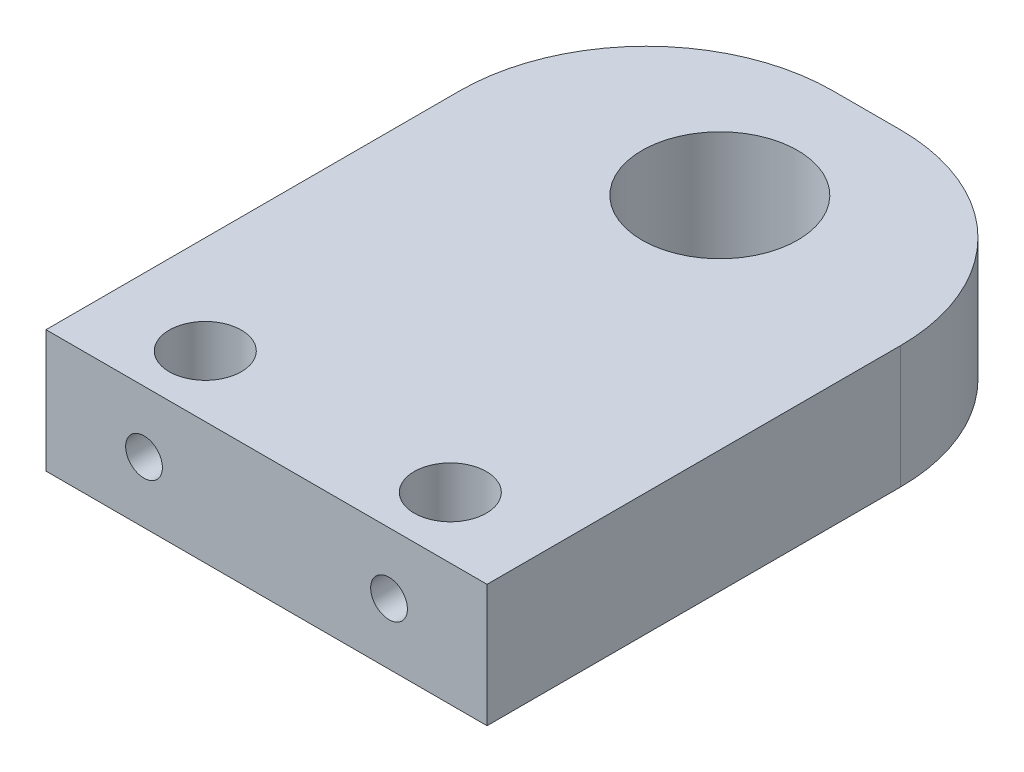
ISO-10303-21;
HEADER;
FILE_DESCRIPTION(('STEP AP214'),'2;1');
FILE_NAME('part.step','',(''),(''),'','','');
FILE_SCHEMA(('AUTOMOTIVE_DESIGN { 1 0 10303 214 1 1 1 1 }'));
ENDSEC;
DATA;
#1=APPLICATION_CONTEXT('core data for automotive mechanical design processes');
#2=APPLICATION_PROTOCOL_DEFINITION('international standard','automotive_design',2000,#1);
#3=PRODUCT_CONTEXT('',#1,'mechanical');
#4=PRODUCT('Part','Part','',(#3));
#5=PRODUCT_RELATED_PRODUCT_CATEGORY('part','',(#4));
#6=PRODUCT_DEFINITION_FORMATION('','',#4);
#7=PRODUCT_DEFINITION_CONTEXT('part definition',#1,'design');
#8=PRODUCT_DEFINITION('design','',#6,#7);
#9=PRODUCT_DEFINITION_SHAPE('','',#8);
#10=(LENGTH_UNIT() NAMED_UNIT(*) SI_UNIT(.MILLI.,.METRE.));
#11=(NAMED_UNIT(*) PLANE_ANGLE_UNIT() SI_UNIT($,.RADIAN.));
#12=(NAMED_UNIT(*) SI_UNIT($,.STERADIAN.) SOLID_ANGLE_UNIT());
#13=UNCERTAINTY_MEASURE_WITH_UNIT(LENGTH_MEASURE(1.E-05),#10,'distance_accuracy_value','');
#14=(GEOMETRIC_REPRESENTATION_CONTEXT(3) GLOBAL_UNCERTAINTY_ASSIGNED_CONTEXT((#13)) GLOBAL_UNIT_ASSIGNED_CONTEXT((#10,
#11,#12)) REPRESENTATION_CONTEXT('',''));
#15=CARTESIAN_POINT('',(0.,0.,0.));
#16=DIRECTION('',(0.,0.,1.));
#17=DIRECTION('',(1.,0.,0.));
#18=AXIS2_PLACEMENT_3D('',#15,#16,#17);
#19=CARTESIAN_POINT('',(0.,5.,0.));
#20=DIRECTION('',(0.,0.,-1.));
#21=DIRECTION('',(-1.,0.,0.));
#22=AXIS2_PLACEMENT_3D('',#19,#20,#21);
#23=PLANE('',#22);
#24=DIRECTION('',(1.,0.,0.));
#25=VECTOR('',#24,1.);
#26=CARTESIAN_POINT('',(0.,0.,0.));
#27=LINE('',#26,#25);
#28=CARTESIAN_POINT('',(-18.,0.,0.));
#29=VERTEX_POINT('',#28);
#30=CARTESIAN_POINT('',(0.,0.,0.));
#31=VERTEX_POINT('',#30);
#32=EDGE_CURVE('E120',#29,#31,#27,.T.);
#33=ORIENTED_EDGE('',*,*,#32,.T.);
#34=DIRECTION('',(0.,-1.,0.));
#35=VECTOR('',#34,1.);
#36=CARTESIAN_POINT('',(0.,5.,0.));
#37=LINE('',#36,#35);
#38=CARTESIAN_POINT('',(0.,5.,0.));
#39=VERTEX_POINT('',#38);
#40=EDGE_CURVE('E105',#39,#31,#37,.T.);
#41=ORIENTED_EDGE('',*,*,#40,.F.);
#42=DIRECTION('',(1.,0.,0.));
#43=VECTOR('',#42,1.);
#44=CARTESIAN_POINT('',(0.,5.,0.));
#45=LINE('',#44,#43);
#46=CARTESIAN_POINT('',(-18.,5.,0.));
#47=VERTEX_POINT('',#46);
#48=EDGE_CURVE('E91',#47,#39,#45,.T.);
#49=ORIENTED_EDGE('',*,*,#48,.F.);
#50=DIRECTION('',(0.,-1.,0.));
#51=VECTOR('',#50,1.);
#52=CARTESIAN_POINT('',(-18.,5.,0.));
#53=LINE('',#52,#51);
#54=EDGE_CURVE('E98',#47,#29,#53,.T.);
#55=ORIENTED_EDGE('',*,*,#54,.T.);
#56=EDGE_LOOP('',(#33,#41,#49,#55));
#57=FACE_BOUND('',#56,.T.);
#58=CARTESIAN_POINT('',(-14.,2.5,0.));
#59=DIRECTION('',(0.,0.,1.));
#60=DIRECTION('',(1.,0.,0.));
#61=AXIS2_PLACEMENT_3D('',#58,#59,#60);
#62=CIRCLE('',#61,0.75);
#63=CARTESIAN_POINT('',(-13.25,2.5,0.));
#64=VERTEX_POINT('',#63);
#65=EDGE_CURVE('E131',#64,#64,#62,.T.);
#66=ORIENTED_EDGE('',*,*,#65,.F.);
#67=EDGE_LOOP('',(#66));
#68=FACE_BOUND('',#67,.T.);
#69=CARTESIAN_POINT('',(-4.,2.5,0.));
#70=DIRECTION('',(0.,0.,-1.));
#71=DIRECTION('',(-1.,0.,0.));
#72=AXIS2_PLACEMENT_3D('',#69,#70,#71);
#73=CIRCLE('',#72,0.75);
#74=CARTESIAN_POINT('',(-4.75,2.5,0.));
#75=VERTEX_POINT('',#74);
#76=EDGE_CURVE('E214',#75,#75,#73,.T.);
#77=ORIENTED_EDGE('',*,*,#76,.T.);
#78=EDGE_LOOP('',(#77));
#79=FACE_BOUND('',#78,.T.);
#80=ADVANCED_FACE('F33',(#57,#68,#79),#23,.F.);
#81=CARTESIAN_POINT('',(-4.,0.,-2.5));
#82=DIRECTION('',(0.,1.,0.));
#83=DIRECTION('',(0.,0.,1.));
#84=AXIS2_PLACEMENT_3D('',#81,#82,#83);
#85=CYLINDRICAL_SURFACE('',#84,1.4732);
#86=CARTESIAN_POINT('',(-4.,5.,-2.5));
#87=DIRECTION('',(0.,-1.,0.));
#88=DIRECTION('',(0.,0.,1.));
#89=AXIS2_PLACEMENT_3D('',#86,#87,#88);
#90=CIRCLE('',#89,1.4732);
#91=CARTESIAN_POINT('',(-4.,5.,-1.0268));
#92=VERTEX_POINT('',#91);
#93=EDGE_CURVE('E209',#92,#92,#90,.T.);
#94=ORIENTED_EDGE('',*,*,#93,.F.);
#95=EDGE_LOOP('',(#94));
#96=FACE_BOUND('',#95,.T.);
#97=CARTESIAN_POINT('',(-4.,0.,-2.5));
#98=DIRECTION('',(0.,-1.,0.));
#99=DIRECTION('',(0.,0.,1.));
#100=AXIS2_PLACEMENT_3D('',#97,#98,#99);
#101=CIRCLE('',#100,1.4732);
#102=CARTESIAN_POINT('',(-4.,0.,-1.0268));
#103=VERTEX_POINT('',#102);
#104=EDGE_CURVE('E208',#103,#103,#101,.T.);
#105=ORIENTED_EDGE('',*,*,#104,.T.);
#106=EDGE_LOOP('',(#105));
#107=FACE_BOUND('',#106,.T.);
#108=CARTESIAN_POINT('',(-4.,1.75,-1.0268));
#109=CARTESIAN_POINT('',(-3.9606575769154,1.75000252182764,-1.02680220611836));
#110=CARTESIAN_POINT('',(-3.92127085127802,1.75311380635591,-1.02839274569372));
#111=CARTESIAN_POINT('',(-3.84366695752669,1.76541875095237,-1.03459878502963));
#112=CARTESIAN_POINT('',(-3.80545203284723,1.77462339836188,-1.03921974900572));
#113=CARTESIAN_POINT('',(-3.73143168372679,1.79865892412454,-1.05100426533486));
#114=CARTESIAN_POINT('',(-3.69561742756561,1.81346767720986,-1.05815781186486));
#115=CARTESIAN_POINT('',(-3.62703792099485,1.84817354316779,-1.07435597490672));
#116=CARTESIAN_POINT('',(-3.59427250190444,1.86807037430738,-1.0834004867085));
#117=CARTESIAN_POINT('',(-3.53043416268617,1.91378875585433,-1.10321390423135));
#118=CARTESIAN_POINT('',(-3.49959239938986,1.93990131852553,-1.11405498369676));
#119=CARTESIAN_POINT('',(-3.44251181723256,1.99668130616915,-1.13601238540455));
#120=CARTESIAN_POINT('',(-3.41627664483487,2.02735230434501,-1.1471289178172));
#121=CARTESIAN_POINT('',(-3.36701624260865,2.09535959625278,-1.16942158074621));
#122=CARTESIAN_POINT('',(-3.34442423922562,2.13303479409838,-1.18052934811384));
#123=CARTESIAN_POINT('',(-3.30599217355733,2.21227127261359,-1.20033012525784));
#124=CARTESIAN_POINT('',(-3.29014716455627,2.25382967886272,-1.2090249025395));
#125=CARTESIAN_POINT('',(-3.2667106686897,2.33708815783487,-1.2221983401406));
#126=CARTESIAN_POINT('',(-3.25867627658924,2.37862626620457,-1.22690103134074));
#127=CARTESIAN_POINT('',(-3.24973928831067,2.4627046380928,-1.23214465460714));
#128=CARTESIAN_POINT('',(-3.2488291632929,2.50524379600033,-1.2326899801115));
#129=CARTESIAN_POINT('',(-3.25384221734925,2.58438886607509,-1.22973613373844));
#130=CARTESIAN_POINT('',(-3.25892473074875,2.62107124425613,-1.22673443128719));
#131=CARTESIAN_POINT('',(-3.2743168786561,2.69296668969559,-1.21790007891102));
#132=CARTESIAN_POINT('',(-3.28462828429265,2.72817925472248,-1.21206646979218));
#133=CARTESIAN_POINT('',(-3.31036687110798,2.7971417479471,-1.19810064393931));
#134=CARTESIAN_POINT('',(-3.32590711622532,2.8308388382548,-1.18991827089551));
#135=CARTESIAN_POINT('',(-3.36157407945457,2.89531155218324,-1.17217207409054));
#136=CARTESIAN_POINT('',(-3.38170285938505,2.92608585364078,-1.16260763001714));
#137=CARTESIAN_POINT('',(-3.42907358339413,2.98811905843063,-1.14164937911975));
#138=CARTESIAN_POINT('',(-3.45690391182593,3.01890499253937,-1.13018081338474));
#139=CARTESIAN_POINT('',(-3.51736916210693,3.07557400398551,-1.10772627824621));
#140=CARTESIAN_POINT('',(-3.55000652867346,3.1014545711918,-1.09674055811675));
#141=CARTESIAN_POINT('',(-3.62121065036388,3.14879467746589,-1.07582331832222));
#142=CARTESIAN_POINT('',(-3.65999168530099,3.16997002579974,-1.06597149335067));
#143=CARTESIAN_POINT('',(-3.74119338186991,3.20531928296675,-1.04912059732702));
#144=CARTESIAN_POINT('',(-3.78361102113814,3.21949894092728,-1.04211918460802));
#145=CARTESIAN_POINT('',(-3.86702605671379,3.23925390951702,-1.0322642707464));
#146=CARTESIAN_POINT('',(-3.90783878203494,3.24545698889539,-1.02910933279456));
#147=CARTESIAN_POINT('',(-3.99004140438883,3.25106282250464,-1.02626089305485));
#148=CARTESIAN_POINT('',(-4.03143100236032,3.25046897833976,-1.02656565981445));
#149=CARTESIAN_POINT('',(-4.11004388958276,3.24284799668576,-1.03043107230061));
#150=CARTESIAN_POINT('',(-4.14733310550133,3.23634581920992,-1.03372600893934));
#151=CARTESIAN_POINT('',(-4.22021205515197,3.21792738586372,-1.04288836560886));
#152=CARTESIAN_POINT('',(-4.2558016040693,3.20601054269962,-1.04875606468811));
#153=CARTESIAN_POINT('',(-4.32542048329048,3.17680614771442,-1.06274002278413));
#154=CARTESIAN_POINT('',(-4.35937907768151,3.15937869059891,-1.07091417915435));
#155=CARTESIAN_POINT('',(-4.42399884376647,3.11980817357101,-1.0887351393782));
#156=CARTESIAN_POINT('',(-4.45465862799573,3.09766314104638,-1.09838255878437));
#157=CARTESIAN_POINT('',(-4.51509372863443,3.04671213453437,-1.1193768507009));
#158=CARTESIAN_POINT('',(-4.54446769612563,3.01745953687217,-1.13079698072104));
#159=CARTESIAN_POINT('',(-4.5980781301437,2.95444016834433,-1.15334919384521));
#160=CARTESIAN_POINT('',(-4.62231071892922,2.92067002132162,-1.16448105401358));
#161=CARTESIAN_POINT('',(-4.66617769744531,2.84731591321446,-1.18578834541354));
#162=CARTESIAN_POINT('',(-4.68549806820531,2.80751798449864,-1.19588114688589));
#163=CARTESIAN_POINT('',(-4.71696120610427,2.724560956178,-1.21290660102605));
#164=CARTESIAN_POINT('',(-4.72911353520273,2.68140642161965,-1.21984346078879));
#165=CARTESIAN_POINT('',(-4.74474877040614,2.59742838681212,-1.22888165798232));
#166=CARTESIAN_POINT('',(-4.74895813510497,2.55678468886243,-1.23138669798332));
#167=CARTESIAN_POINT('',(-4.75069842260732,2.47531221208382,-1.23241473572249));
#168=CARTESIAN_POINT('',(-4.74823261605862,2.43448353367685,-1.23093968359598));
#169=CARTESIAN_POINT('',(-4.73737767764283,2.35820390915363,-1.22460825366367));
#170=CARTESIAN_POINT('',(-4.72961872994686,2.32262937710914,-1.22011231848875));
#171=CARTESIAN_POINT('',(-4.70919744096633,2.25333285712194,-1.20868543628832));
#172=CARTESIAN_POINT('',(-4.6965334724026,2.21961148822462,-1.20175368123131));
#173=CARTESIAN_POINT('',(-4.66571945055161,2.1524770700304,-1.18567267984056));
#174=CARTESIAN_POINT('',(-4.64725924790321,2.11923532867513,-1.17640617206837));
#175=CARTESIAN_POINT('',(-4.60570968434182,2.05610179697262,-1.15688390470307));
#176=CARTESIAN_POINT('',(-4.58261787360086,2.02621179258232,-1.14662762307809));
#177=CARTESIAN_POINT('',(-4.52900879336052,1.96665905934449,-1.12471503727741));
#178=CARTESIAN_POINT('',(-4.49791995330916,1.93751228683933,-1.11304712612774));
#179=CARTESIAN_POINT('',(-4.43098723530952,1.8847222720177,-1.09081189075967));
#180=CARTESIAN_POINT('',(-4.39514069295212,1.86108213411612,-1.08024518920398));
#181=CARTESIAN_POINT('',(-4.31904012814387,1.81984774473697,-1.0612204142898));
#182=CARTESIAN_POINT('',(-4.27874104058887,1.80232453391943,-1.05278741193376));
#183=CARTESIAN_POINT('',(-4.19525709236962,1.77453604062966,-1.03918941052837));
#184=CARTESIAN_POINT('',(-4.15208068628279,1.7642504388377,-1.03401526667987));
#185=CARTESIAN_POINT('',(-4.09036566113959,1.75524285719092,-1.02946337062287));
#186=CARTESIAN_POINT('',(-4.07236660880907,1.75327979281625,-1.02846742332499));
#187=CARTESIAN_POINT('',(-4.03624817540604,1.75065776575804,-1.02713522090723));
#188=CARTESIAN_POINT('',(-4.01812879112818,1.74999883795448,-1.02679898343173));
#189=CARTESIAN_POINT('',(-4.,1.75,-1.0268));
#190=B_SPLINE_CURVE_WITH_KNOTS('',3,(#108,#109,#110,#111,#112,#113,#114,#115,#116,#117,#118,
#119,#120,#121,#122,#123,#124,#125,#126,#127,#128,#129,#130,#131,#132,#133,#134,#135,#136,#137,
#138,#139,#140,#141,#142,#143,#144,#145,#146,#147,#148,#149,#150,#151,#152,#153,#154,#155,#156,
#157,#158,#159,#160,#161,#162,#163,#164,#165,#166,#167,#168,#169,#170,#171,#172,#173,#174,#175,
#176,#177,#178,#179,#180,#181,#182,#183,#184,#185,#186,#187,#188,#189),.UNSPECIFIED.,.T.,.F.,(4,
2,2,2,2,2,2,2,2,2,2,2,2,2,2,2,2,2,2,2,2,2,2,2,2,2,2,2,2,2,2,2,2,2,2,2,2,2,2,2,4),(0.,
0.117953831094887,0.236120933920976,0.353826294049233,0.471525138100365,0.596526863752337,
0.721627095925648,0.856878751847196,0.992031073414538,1.11897330231829,1.24578136206803,
1.35672452799631,1.46770529768442,1.58125909715074,1.69486402196815,1.82347557718113,
1.95215276773095,2.08723511632051,2.22220626721413,2.34572997941948,2.46919187536339,
2.58265398090853,2.69612839589246,2.81275280644665,2.92942607851709,3.05787110094433,
3.18641265774705,3.32180714125343,3.45702060157646,3.5791212303752,3.70116204410018,
3.81074803422157,3.92037041153902,4.03732101273993,4.1543336373271,4.28628145323537,
4.4183034768474,4.55181140017204,4.68494299314672,4.7392940729611,4.79364660641054),.UNSPECIFIED.);
#191=CARTESIAN_POINT('',(-4.,1.75,-1.0268));
#192=VERTEX_POINT('',#191);
#193=EDGE_CURVE('E132',#192,#192,#190,.T.);
#194=ORIENTED_EDGE('',*,*,#193,.T.);
#195=EDGE_LOOP('',(#194));
#196=FACE_BOUND('',#195,.T.);
#197=ADVANCED_FACE('F146',(#96,#107,#196),#85,.F.);
#198=CARTESIAN_POINT('',(0.,5.,-24.5));
#199=DIRECTION('',(0.,1.,0.));
#200=DIRECTION('',(0.,0.,1.));
#201=AXIS2_PLACEMENT_3D('',#198,#199,#200);
#202=PLANE('',#201);
#203=CARTESIAN_POINT('',(-9.,5.,-18.5));
#204=DIRECTION('',(0.,1.,0.));
#205=DIRECTION('',(0.,0.,1.));
#206=AXIS2_PLACEMENT_3D('',#203,#204,#205);
#207=CIRCLE('',#206,3.175);
#208=CARTESIAN_POINT('',(-9.,5.,-15.325));
#209=VERTEX_POINT('',#208);
#210=EDGE_CURVE('E220',#209,#209,#207,.T.);
#211=ORIENTED_EDGE('',*,*,#210,.F.);
#212=EDGE_LOOP('',(#211));
#213=FACE_BOUND('',#212,.T.);
#214=DIRECTION('',(0.,0.,-1.));
#215=VECTOR('',#214,1.);
#216=CARTESIAN_POINT('',(0.,5.,0.));
#217=LINE('',#216,#215);
#218=CARTESIAN_POINT('',(0.,5.,-16.88));
#219=VERTEX_POINT('',#218);
#220=EDGE_CURVE('E121',#39,#219,#217,.T.);
#221=ORIENTED_EDGE('',*,*,#220,.T.);
#222=CARTESIAN_POINT('',(-7.62,5.,-16.88));
#223=DIRECTION('',(0.,1.,0.));
#224=DIRECTION('',(0.,0.,1.));
#225=AXIS2_PLACEMENT_3D('',#222,#223,#224);
#226=CIRCLE('',#225,7.62);
#227=CARTESIAN_POINT('',(-7.62,5.,-24.5));
#228=VERTEX_POINT('',#227);
#229=EDGE_CURVE('E41',#219,#228,#226,.T.);
#230=ORIENTED_EDGE('',*,*,#229,.T.);
#231=DIRECTION('',(-1.,0.,0.));
#232=VECTOR('',#231,1.);
#233=CARTESIAN_POINT('',(0.,5.,-24.5));
#234=LINE('',#233,#232);
#235=CARTESIAN_POINT('',(-10.38,5.,-24.5));
#236=VERTEX_POINT('',#235);
#237=EDGE_CURVE('E95',#228,#236,#234,.T.);
#238=ORIENTED_EDGE('',*,*,#237,.T.);
#239=CARTESIAN_POINT('',(-10.38,5.,-16.88));
#240=DIRECTION('',(0.,1.,0.));
#241=DIRECTION('',(0.,0.,1.));
#242=AXIS2_PLACEMENT_3D('',#239,#240,#241);
#243=CIRCLE('',#242,7.62);
#244=CARTESIAN_POINT('',(-18.,5.,-16.88));
#245=VERTEX_POINT('',#244);
#246=EDGE_CURVE('E48',#236,#245,#243,.T.);
#247=ORIENTED_EDGE('',*,*,#246,.T.);
#248=DIRECTION('',(0.,0.,1.));
#249=VECTOR('',#248,1.);
#250=CARTESIAN_POINT('',(-18.,5.,0.));
#251=LINE('',#250,#249);
#252=EDGE_CURVE('E86',#245,#47,#251,.T.);
#253=ORIENTED_EDGE('',*,*,#252,.T.);
#254=ORIENTED_EDGE('',*,*,#48,.T.);
#255=EDGE_LOOP('',(#221,#230,#238,#247,#253,#254));
#256=FACE_BOUND('',#255,.T.);
#257=CARTESIAN_POINT('',(-14.,5.,-2.5));
#258=DIRECTION('',(0.,1.,0.));
#259=DIRECTION('',(0.,0.,1.));
#260=AXIS2_PLACEMENT_3D('',#257,#258,#259);
#261=CIRCLE('',#260,1.4732);
#262=CARTESIAN_POINT('',(-14.,5.,-1.0268));
#263=VERTEX_POINT('',#262);
#264=EDGE_CURVE('E130',#263,#263,#261,.T.);
#265=ORIENTED_EDGE('',*,*,#264,.F.);
#266=EDGE_LOOP('',(#265));
#267=FACE_BOUND('',#266,.T.);
#268=ORIENTED_EDGE('',*,*,#93,.T.);
#269=EDGE_LOOP('',(#268));
#270=FACE_BOUND('',#269,.T.);
#271=ADVANCED_FACE('F88',(#213,#256,#267,#270),#202,.T.);
#272=CARTESIAN_POINT('',(0.,0.,-24.5));
#273=DIRECTION('',(0.,1.,0.));
#274=DIRECTION('',(0.,0.,1.));
#275=AXIS2_PLACEMENT_3D('',#272,#273,#274);
#276=PLANE('',#275);
#277=CARTESIAN_POINT('',(-9.,0.,-18.5));
#278=DIRECTION('',(0.,1.,0.));
#279=DIRECTION('',(0.,0.,1.));
#280=AXIS2_PLACEMENT_3D('',#277,#278,#279);
#281=CIRCLE('',#280,3.175);
#282=CARTESIAN_POINT('',(-9.,0.,-15.325));
#283=VERTEX_POINT('',#282);
#284=EDGE_CURVE('E217',#283,#283,#281,.T.);
#285=ORIENTED_EDGE('',*,*,#284,.T.);
#286=EDGE_LOOP('',(#285));
#287=FACE_BOUND('',#286,.T.);
#288=DIRECTION('',(-1.,0.,0.));
#289=VECTOR('',#288,1.);
#290=CARTESIAN_POINT('',(0.,0.,-24.5));
#291=LINE('',#290,#289);
#292=CARTESIAN_POINT('',(-7.62,0.,-24.5));
#293=VERTEX_POINT('',#292);
#294=CARTESIAN_POINT('',(-10.38,0.,-24.5));
#295=VERTEX_POINT('',#294);
#296=EDGE_CURVE('E115',#293,#295,#291,.T.);
#297=ORIENTED_EDGE('',*,*,#296,.F.);
#298=CARTESIAN_POINT('',(-7.62,0.,-16.88));
#299=DIRECTION('',(0.,1.,0.));
#300=DIRECTION('',(0.,0.,1.));
#301=AXIS2_PLACEMENT_3D('',#298,#299,#300);
#302=CIRCLE('',#301,7.62);
#303=CARTESIAN_POINT('',(0.,0.,-16.88));
#304=VERTEX_POINT('',#303);
#305=EDGE_CURVE('E191',#293,#304,#302,.F.);
#306=ORIENTED_EDGE('',*,*,#305,.T.);
#307=DIRECTION('',(0.,0.,-1.));
#308=VECTOR('',#307,1.);
#309=CARTESIAN_POINT('',(0.,0.,0.));
#310=LINE('',#309,#308);
#311=EDGE_CURVE('E113',#31,#304,#310,.T.);
#312=ORIENTED_EDGE('',*,*,#311,.F.);
#313=ORIENTED_EDGE('',*,*,#32,.F.);
#314=DIRECTION('',(0.,0.,1.));
#315=VECTOR('',#314,1.);
#316=CARTESIAN_POINT('',(-18.,0.,0.));
#317=LINE('',#316,#315);
#318=CARTESIAN_POINT('',(-18.,0.,-16.88));
#319=VERTEX_POINT('',#318);
#320=EDGE_CURVE('E101',#319,#29,#317,.T.);
#321=ORIENTED_EDGE('',*,*,#320,.F.);
#322=CARTESIAN_POINT('',(-10.38,0.,-16.88));
#323=DIRECTION('',(0.,1.,0.));
#324=DIRECTION('',(0.,0.,1.));
#325=AXIS2_PLACEMENT_3D('',#322,#323,#324);
#326=CIRCLE('',#325,7.62);
#327=EDGE_CURVE('E193',#319,#295,#326,.F.);
#328=ORIENTED_EDGE('',*,*,#327,.T.);
#329=EDGE_LOOP('',(#297,#306,#312,#313,#321,#328));
#330=FACE_BOUND('',#329,.T.);
#331=CARTESIAN_POINT('',(-14.,0.,-2.5));
#332=DIRECTION('',(0.,1.,0.));
#333=DIRECTION('',(0.,0.,1.));
#334=AXIS2_PLACEMENT_3D('',#331,#332,#333);
#335=CIRCLE('',#334,1.4732);
#336=CARTESIAN_POINT('',(-14.,0.,-1.0268));
#337=VERTEX_POINT('',#336);
#338=EDGE_CURVE('E116',#337,#337,#335,.T.);
#339=ORIENTED_EDGE('',*,*,#338,.T.);
#340=EDGE_LOOP('',(#339));
#341=FACE_BOUND('',#340,.T.);
#342=ORIENTED_EDGE('',*,*,#104,.F.);
#343=EDGE_LOOP('',(#342));
#344=FACE_BOUND('',#343,.T.);
#345=ADVANCED_FACE('F170',(#287,#330,#341,#344),#276,.F.);
#346=CARTESIAN_POINT('',(0.,5.,0.));
#347=DIRECTION('',(-1.,0.,0.));
#348=DIRECTION('',(0.,0.,1.));
#349=AXIS2_PLACEMENT_3D('',#346,#347,#348);
#350=PLANE('',#349);
#351=ORIENTED_EDGE('',*,*,#311,.T.);
#352=DIRECTION('',(0.,-1.,0.));
#353=VECTOR('',#352,1.);
#354=CARTESIAN_POINT('',(0.,5.,-16.88));
#355=LINE('',#354,#353);
#356=EDGE_CURVE('E56',#304,#219,#355,.F.);
#357=ORIENTED_EDGE('',*,*,#356,.T.);
#358=ORIENTED_EDGE('',*,*,#220,.F.);
#359=ORIENTED_EDGE('',*,*,#40,.T.);
#360=EDGE_LOOP('',(#351,#357,#358,#359));
#361=FACE_BOUND('',#360,.T.);
#362=ADVANCED_FACE('F176',(#361),#350,.F.);
#363=CARTESIAN_POINT('',(0.,5.,-24.5));
#364=DIRECTION('',(0.,0.,1.));
#365=DIRECTION('',(1.,0.,0.));
#366=AXIS2_PLACEMENT_3D('',#363,#364,#365);
#367=PLANE('',#366);
#368=ORIENTED_EDGE('',*,*,#237,.F.);
#369=DIRECTION('',(0.,-1.,0.));
#370=VECTOR('',#369,1.);
#371=CARTESIAN_POINT('',(-7.62,5.,-24.5));
#372=LINE('',#371,#370);
#373=EDGE_CURVE('E186',#228,#293,#372,.T.);
#374=ORIENTED_EDGE('',*,*,#373,.T.);
#375=ORIENTED_EDGE('',*,*,#296,.T.);
#376=DIRECTION('',(0.,-1.,0.));
#377=VECTOR('',#376,1.);
#378=CARTESIAN_POINT('',(-10.38,5.,-24.5));
#379=LINE('',#378,#377);
#380=EDGE_CURVE('E104',#295,#236,#379,.F.);
#381=ORIENTED_EDGE('',*,*,#380,.T.);
#382=EDGE_LOOP('',(#368,#374,#375,#381));
#383=FACE_BOUND('',#382,.T.);
#384=ADVANCED_FACE('F173',(#383),#367,.F.);
#385=CARTESIAN_POINT('',(-18.,5.,0.));
#386=DIRECTION('',(1.,0.,0.));
#387=DIRECTION('',(0.,0.,-1.));
#388=AXIS2_PLACEMENT_3D('',#385,#386,#387);
#389=PLANE('',#388);
#390=ORIENTED_EDGE('',*,*,#252,.F.);
#391=DIRECTION('',(0.,-1.,0.));
#392=VECTOR('',#391,1.);
#393=CARTESIAN_POINT('',(-18.,5.,-16.88));
#394=LINE('',#393,#392);
#395=EDGE_CURVE('E11',#245,#319,#394,.T.);
#396=ORIENTED_EDGE('',*,*,#395,.T.);
#397=ORIENTED_EDGE('',*,*,#320,.T.);
#398=ORIENTED_EDGE('',*,*,#54,.F.);
#399=EDGE_LOOP('',(#390,#396,#397,#398));
#400=FACE_BOUND('',#399,.T.);
#401=ADVANCED_FACE('F99',(#400),#389,.F.);
#402=CARTESIAN_POINT('',(-14.,0.,-2.5));
#403=DIRECTION('',(0.,1.,0.));
#404=DIRECTION('',(0.,0.,1.));
#405=AXIS2_PLACEMENT_3D('',#402,#403,#404);
#406=CYLINDRICAL_SURFACE('',#405,1.4732);
#407=CARTESIAN_POINT('',(-14.,1.75,-1.0268));
#408=CARTESIAN_POINT('',(-13.9606575769154,1.75000252182764,-1.02680220611836));
#409=CARTESIAN_POINT('',(-13.921270851278,1.75311380635591,-1.02839274569372));
#410=CARTESIAN_POINT('',(-13.8436669575267,1.76541875095237,-1.03459878502963));
#411=CARTESIAN_POINT('',(-13.8054520328472,1.77462339836188,-1.03921974900572));
#412=CARTESIAN_POINT('',(-13.7314316837268,1.79865892412454,-1.05100426533486));
#413=CARTESIAN_POINT('',(-13.6956174275656,1.81346767720986,-1.05815781186486));
#414=CARTESIAN_POINT('',(-13.6270379209948,1.84817354316779,-1.07435597490672));
#415=CARTESIAN_POINT('',(-13.5942725019044,1.86807037430738,-1.0834004867085));
#416=CARTESIAN_POINT('',(-13.5304341626862,1.91378875585433,-1.10321390423135));
#417=CARTESIAN_POINT('',(-13.4995923993899,1.93990131852553,-1.11405498369676));
#418=CARTESIAN_POINT('',(-13.4425118172326,1.99668130616915,-1.13601238540455));
#419=CARTESIAN_POINT('',(-13.4162766448349,2.02735230434501,-1.1471289178172));
#420=CARTESIAN_POINT('',(-13.3670162426086,2.09535959625278,-1.16942158074621));
#421=CARTESIAN_POINT('',(-13.3444242392256,2.13303479409838,-1.18052934811384));
#422=CARTESIAN_POINT('',(-13.3059921735573,2.21227127261359,-1.20033012525784));
#423=CARTESIAN_POINT('',(-13.2901471645563,2.25382967886272,-1.2090249025395));
#424=CARTESIAN_POINT('',(-13.2667106686897,2.33708815783487,-1.2221983401406));
#425=CARTESIAN_POINT('',(-13.2586762765892,2.37862626620457,-1.22690103134074));
#426=CARTESIAN_POINT('',(-13.2497392883107,2.4627046380928,-1.23214465460714));
#427=CARTESIAN_POINT('',(-13.2488291632929,2.50524379600033,-1.2326899801115));
#428=CARTESIAN_POINT('',(-13.2538422173493,2.58438886607509,-1.22973613373844));
#429=CARTESIAN_POINT('',(-13.2589247307488,2.62107124425613,-1.22673443128719));
#430=CARTESIAN_POINT('',(-13.2743168786561,2.69296668969559,-1.21790007891102));
#431=CARTESIAN_POINT('',(-13.2846282842926,2.72817925472248,-1.21206646979218));
#432=CARTESIAN_POINT('',(-13.310366871108,2.7971417479471,-1.19810064393931));
#433=CARTESIAN_POINT('',(-13.3259071162253,2.8308388382548,-1.18991827089551));
#434=CARTESIAN_POINT('',(-13.3615740794546,2.89531155218324,-1.17217207409054));
#435=CARTESIAN_POINT('',(-13.381702859385,2.92608585364078,-1.16260763001714));
#436=CARTESIAN_POINT('',(-13.4290735833941,2.98811905843063,-1.14164937911975));
#437=CARTESIAN_POINT('',(-13.4569039118259,3.01890499253937,-1.13018081338474));
#438=CARTESIAN_POINT('',(-13.5173691621069,3.07557400398551,-1.10772627824621));
#439=CARTESIAN_POINT('',(-13.5500065286735,3.1014545711918,-1.09674055811675));
#440=CARTESIAN_POINT('',(-13.6212106503639,3.14879467746589,-1.07582331832222));
#441=CARTESIAN_POINT('',(-13.659991685301,3.16997002579974,-1.06597149335067));
#442=CARTESIAN_POINT('',(-13.7411933818699,3.20531928296675,-1.04912059732702));
#443=CARTESIAN_POINT('',(-13.7836110211381,3.21949894092728,-1.04211918460802));
#444=CARTESIAN_POINT('',(-13.8670260567138,3.23925390951702,-1.0322642707464));
#445=CARTESIAN_POINT('',(-13.9078387820349,3.24545698889539,-1.02910933279456));
#446=CARTESIAN_POINT('',(-13.9900414043888,3.25106282250464,-1.02626089305485));
#447=CARTESIAN_POINT('',(-14.0314310023603,3.25046897833976,-1.02656565981445));
#448=CARTESIAN_POINT('',(-14.1100438895828,3.24284799668576,-1.03043107230061));
#449=CARTESIAN_POINT('',(-14.1473331055013,3.23634581920992,-1.03372600893934));
#450=CARTESIAN_POINT('',(-14.220212055152,3.21792738586372,-1.04288836560886));
#451=CARTESIAN_POINT('',(-14.2558016040693,3.20601054269962,-1.04875606468811));
#452=CARTESIAN_POINT('',(-14.3254204832905,3.17680614771442,-1.06274002278413));
#453=CARTESIAN_POINT('',(-14.3593790776815,3.15937869059891,-1.07091417915435));
#454=CARTESIAN_POINT('',(-14.4239988437665,3.11980817357101,-1.0887351393782));
#455=CARTESIAN_POINT('',(-14.4546586279957,3.09766314104638,-1.09838255878437));
#456=CARTESIAN_POINT('',(-14.5150937286344,3.04671213453437,-1.1193768507009));
#457=CARTESIAN_POINT('',(-14.5444676961256,3.01745953687217,-1.13079698072104));
#458=CARTESIAN_POINT('',(-14.5980781301437,2.95444016834433,-1.15334919384521));
#459=CARTESIAN_POINT('',(-14.6223107189292,2.92067002132162,-1.16448105401358));
#460=CARTESIAN_POINT('',(-14.6661776974453,2.84731591321446,-1.18578834541354));
#461=CARTESIAN_POINT('',(-14.6854980682053,2.80751798449863,-1.19588114688589));
#462=CARTESIAN_POINT('',(-14.7169612061043,2.724560956178,-1.21290660102605));
#463=CARTESIAN_POINT('',(-14.7291135352027,2.68140642161965,-1.21984346078879));
#464=CARTESIAN_POINT('',(-14.7447487704061,2.59742838681212,-1.22888165798232));
#465=CARTESIAN_POINT('',(-14.748958135105,2.55678468886243,-1.23138669798332));
#466=CARTESIAN_POINT('',(-14.7506984226073,2.47531221208382,-1.23241473572249));
#467=CARTESIAN_POINT('',(-14.7482326160586,2.43448353367685,-1.23093968359598));
#468=CARTESIAN_POINT('',(-14.7373776776428,2.35820390915363,-1.22460825366367));
#469=CARTESIAN_POINT('',(-14.7296187299469,2.32262937710914,-1.22011231848875));
#470=CARTESIAN_POINT('',(-14.7091974409663,2.25333285712194,-1.20868543628832));
#471=CARTESIAN_POINT('',(-14.6965334724026,2.21961148822462,-1.20175368123131));
#472=CARTESIAN_POINT('',(-14.6657194505516,2.1524770700304,-1.18567267984056));
#473=CARTESIAN_POINT('',(-14.6472592479032,2.11923532867513,-1.17640617206837));
#474=CARTESIAN_POINT('',(-14.6057096843418,2.05610179697261,-1.15688390470307));
#475=CARTESIAN_POINT('',(-14.5826178736009,2.02621179258232,-1.14662762307809));
#476=CARTESIAN_POINT('',(-14.5290087933605,1.96665905934448,-1.12471503727741));
#477=CARTESIAN_POINT('',(-14.4979199533092,1.93751228683933,-1.11304712612774));
#478=CARTESIAN_POINT('',(-14.4309872353095,1.8847222720177,-1.09081189075967));
#479=CARTESIAN_POINT('',(-14.3951406929521,1.86108213411612,-1.08024518920398));
#480=CARTESIAN_POINT('',(-14.3190401281439,1.81984774473697,-1.0612204142898));
#481=CARTESIAN_POINT('',(-14.2787410405889,1.80232453391943,-1.05278741193376));
#482=CARTESIAN_POINT('',(-14.1952570923696,1.77453604062966,-1.03918941052837));
#483=CARTESIAN_POINT('',(-14.1520806862828,1.7642504388377,-1.03401526667987));
#484=CARTESIAN_POINT('',(-14.0903656611396,1.75524285719092,-1.02946337062287));
#485=CARTESIAN_POINT('',(-14.0723666088091,1.75327979281625,-1.02846742332499));
#486=CARTESIAN_POINT('',(-14.036248175406,1.75065776575804,-1.02713522090723));
#487=CARTESIAN_POINT('',(-14.0181287911282,1.74999883795448,-1.02679898343173));
#488=CARTESIAN_POINT('',(-14.,1.75,-1.0268));
#489=B_SPLINE_CURVE_WITH_KNOTS('',3,(#407,#408,#409,#410,#411,#412,#413,#414,#415,#416,#417,
#418,#419,#420,#421,#422,#423,#424,#425,#426,#427,#428,#429,#430,#431,#432,#433,#434,#435,#436,
#437,#438,#439,#440,#441,#442,#443,#444,#445,#446,#447,#448,#449,#450,#451,#452,#453,#454,#455,
#456,#457,#458,#459,#460,#461,#462,#463,#464,#465,#466,#467,#468,#469,#470,#471,#472,#473,#474,
#475,#476,#477,#478,#479,#480,#481,#482,#483,#484,#485,#486,#487,#488),.UNSPECIFIED.,.T.,.F.,(4,
2,2,2,2,2,2,2,2,2,2,2,2,2,2,2,2,2,2,2,2,2,2,2,2,2,2,2,2,2,2,2,2,2,2,2,2,2,2,2,4),(0.,
0.117953831094887,0.236120933920976,0.353826294049233,0.471525138100365,0.596526863752335,
0.721627095925647,0.856878751847196,0.992031073414537,1.11897330231829,1.24578136206803,
1.35672452799631,1.46770529768442,1.58125909715074,1.69486402196815,1.82347557718113,
1.95215276773096,2.08723511632051,2.22220626721413,2.34572997941948,2.46919187536339,
2.58265398090853,2.69612839589246,2.81275280644665,2.92942607851709,3.05787110094433,
3.18641265774705,3.32180714125343,3.45702060157646,3.5791212303752,3.70116204410018,
3.81074803422157,3.92037041153902,4.03732101273993,4.1543336373271,4.28628145323537,
4.4183034768474,4.55181140017204,4.68494299314672,4.7392940729611,4.79364660641054),.UNSPECIFIED.);
#490=CARTESIAN_POINT('',(-14.,1.75,-1.0268));
#491=VERTEX_POINT('',#490);
#492=EDGE_CURVE('E123',#491,#491,#489,.T.);
#493=ORIENTED_EDGE('',*,*,#492,.T.);
#494=EDGE_LOOP('',(#493));
#495=FACE_BOUND('',#494,.T.);
#496=ORIENTED_EDGE('',*,*,#338,.F.);
#497=EDGE_LOOP('',(#496));
#498=FACE_BOUND('',#497,.T.);
#499=ORIENTED_EDGE('',*,*,#264,.T.);
#500=EDGE_LOOP('',(#499));
#501=FACE_BOUND('',#500,.T.);
#502=ADVANCED_FACE('F138',(#495,#498,#501),#406,.F.);
#503=CARTESIAN_POINT('',(-14.,2.5,-2.46));
#504=DIRECTION('',(0.,0.,1.));
#505=DIRECTION('',(1.,0.,0.));
#506=AXIS2_PLACEMENT_3D('',#503,#504,#505);
#507=CYLINDRICAL_SURFACE('',#506,0.75);
#508=ORIENTED_EDGE('',*,*,#65,.T.);
#509=EDGE_LOOP('',(#508));
#510=FACE_BOUND('',#509,.T.);
#511=ORIENTED_EDGE('',*,*,#492,.F.);
#512=EDGE_LOOP('',(#511));
#513=FACE_BOUND('',#512,.T.);
#514=ADVANCED_FACE('F141',(#510,#513),#507,.F.);
#515=CARTESIAN_POINT('',(-4.,2.5,-2.46));
#516=DIRECTION('',(0.,0.,1.));
#517=DIRECTION('',(1.,0.,0.));
#518=AXIS2_PLACEMENT_3D('',#515,#516,#517);
#519=CYLINDRICAL_SURFACE('',#518,0.75);
#520=ORIENTED_EDGE('',*,*,#193,.F.);
#521=EDGE_LOOP('',(#520));
#522=FACE_BOUND('',#521,.T.);
#523=ORIENTED_EDGE('',*,*,#76,.F.);
#524=EDGE_LOOP('',(#523));
#525=FACE_BOUND('',#524,.T.);
#526=ADVANCED_FACE('F144',(#522,#525),#519,.F.);
#527=CARTESIAN_POINT('',(-7.62,5.,-16.88));
#528=DIRECTION('',(0.,-1.,0.));
#529=DIRECTION('',(0.,0.,-1.));
#530=AXIS2_PLACEMENT_3D('',#527,#528,#529);
#531=CYLINDRICAL_SURFACE('',#530,7.62);
#532=ORIENTED_EDGE('',*,*,#229,.F.);
#533=ORIENTED_EDGE('',*,*,#356,.F.);
#534=ORIENTED_EDGE('',*,*,#305,.F.);
#535=ORIENTED_EDGE('',*,*,#373,.F.);
#536=EDGE_LOOP('',(#532,#533,#534,#535));
#537=FACE_BOUND('',#536,.T.);
#538=ADVANCED_FACE('F153',(#537),#531,.T.);
#539=CARTESIAN_POINT('',(-10.38,5.,-16.88));
#540=DIRECTION('',(0.,-1.,0.));
#541=DIRECTION('',(0.,0.,-1.));
#542=AXIS2_PLACEMENT_3D('',#539,#540,#541);
#543=CYLINDRICAL_SURFACE('',#542,7.62);
#544=ORIENTED_EDGE('',*,*,#246,.F.);
#545=ORIENTED_EDGE('',*,*,#380,.F.);
#546=ORIENTED_EDGE('',*,*,#327,.F.);
#547=ORIENTED_EDGE('',*,*,#395,.F.);
#548=EDGE_LOOP('',(#544,#545,#546,#547));
#549=FACE_BOUND('',#548,.T.);
#550=ADVANCED_FACE('F35',(#549),#543,.T.);
#551=CARTESIAN_POINT('',(-9.,5.,-18.5));
#552=DIRECTION('',(0.,1.,0.));
#553=DIRECTION('',(0.,0.,1.));
#554=AXIS2_PLACEMENT_3D('',#551,#552,#553);
#555=CYLINDRICAL_SURFACE('',#554,3.175);
#556=ORIENTED_EDGE('',*,*,#210,.T.);
#557=EDGE_LOOP('',(#556));
#558=FACE_BOUND('',#557,.T.);
#559=ORIENTED_EDGE('',*,*,#284,.F.);
#560=EDGE_LOOP('',(#559));
#561=FACE_BOUND('',#560,.T.);
#562=ADVANCED_FACE('F155',(#558,#561),#555,.F.);
#563=CLOSED_SHELL('',(#80,#197,#271,#345,#362,#384,#401,#502,#514,#526,#538,#550,#562));
#564=MANIFOLD_SOLID_BREP('B2',#563);
#565=ADVANCED_BREP_SHAPE_REPRESENTATION('',(#18,#564),#14);
#566=SHAPE_DEFINITION_REPRESENTATION(#9,#565);
ENDSEC;
END-ISO-10303-21;
